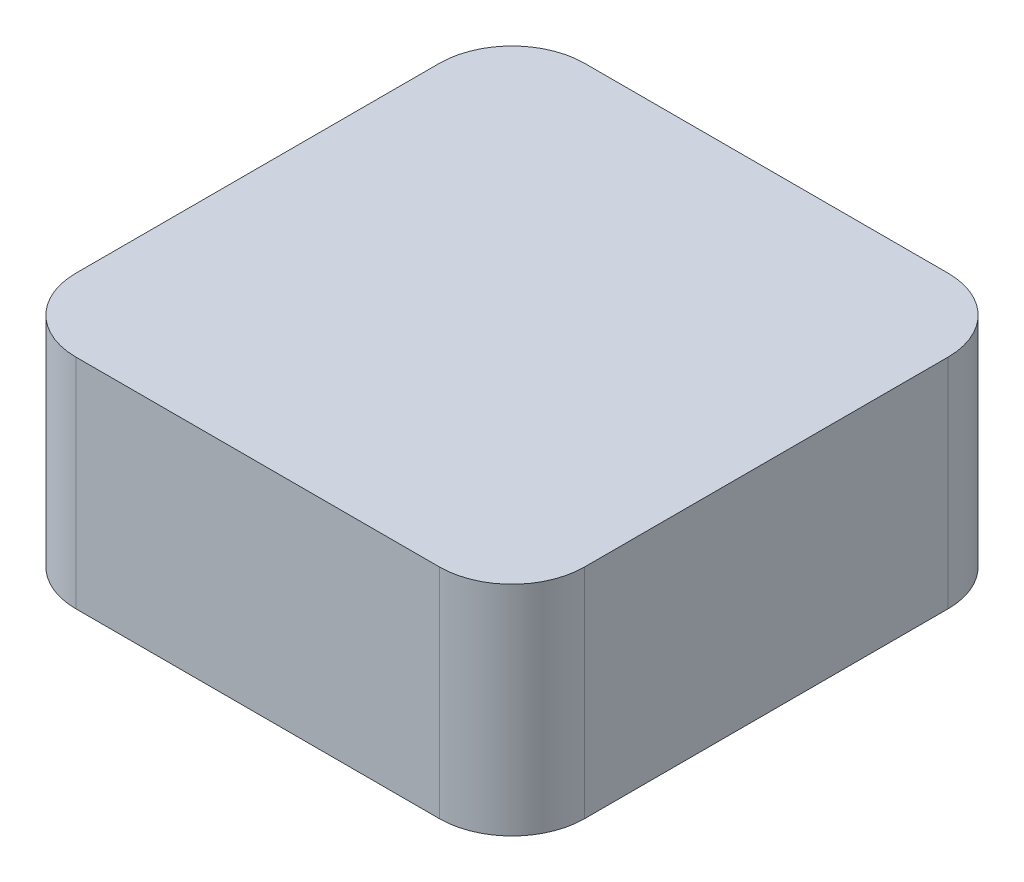
ISO-10303-21;
HEADER;
FILE_DESCRIPTION(('STEP AP214'),'2;1');
FILE_NAME('part.step','',(''),(''),'','','');
FILE_SCHEMA(('AUTOMOTIVE_DESIGN { 1 0 10303 214 1 1 1 1 }'));
ENDSEC;
DATA;
#1=APPLICATION_CONTEXT('core data for automotive mechanical design processes');
#2=APPLICATION_PROTOCOL_DEFINITION('international standard','automotive_design',2000,#1);
#3=PRODUCT_CONTEXT('',#1,'mechanical');
#4=PRODUCT('Part','Part','',(#3));
#5=PRODUCT_RELATED_PRODUCT_CATEGORY('part','',(#4));
#6=PRODUCT_DEFINITION_FORMATION('','',#4);
#7=PRODUCT_DEFINITION_CONTEXT('part definition',#1,'design');
#8=PRODUCT_DEFINITION('design','',#6,#7);
#9=PRODUCT_DEFINITION_SHAPE('','',#8);
#10=(LENGTH_UNIT() NAMED_UNIT(*) SI_UNIT(.MILLI.,.METRE.));
#11=(NAMED_UNIT(*) PLANE_ANGLE_UNIT() SI_UNIT($,.RADIAN.));
#12=(NAMED_UNIT(*) SI_UNIT($,.STERADIAN.) SOLID_ANGLE_UNIT());
#13=UNCERTAINTY_MEASURE_WITH_UNIT(LENGTH_MEASURE(1.E-05),#10,'distance_accuracy_value','');
#14=(GEOMETRIC_REPRESENTATION_CONTEXT(3) GLOBAL_UNCERTAINTY_ASSIGNED_CONTEXT((#13)) GLOBAL_UNIT_ASSIGNED_CONTEXT((#10,
#11,#12)) REPRESENTATION_CONTEXT('',''));
#15=CARTESIAN_POINT('',(0.,0.,0.));
#16=DIRECTION('',(0.,0.,1.));
#17=DIRECTION('',(1.,0.,0.));
#18=AXIS2_PLACEMENT_3D('',#15,#16,#17);
#19=CARTESIAN_POINT('',(31.75,38.1,-31.75));
#20=DIRECTION('',(0.,-1.,0.));
#21=DIRECTION('',(0.,0.,-1.));
#22=AXIS2_PLACEMENT_3D('',#19,#20,#21);
#23=CYLINDRICAL_SURFACE('',#22,12.7);
#24=CARTESIAN_POINT('',(31.75,0.,-31.75));
#25=DIRECTION('',(0.,1.,0.));
#26=DIRECTION('',(0.,0.,-1.));
#27=AXIS2_PLACEMENT_3D('',#24,#25,#26);
#28=CIRCLE('',#27,12.7);
#29=CARTESIAN_POINT('',(44.45,0.,-31.75));
#30=VERTEX_POINT('',#29);
#31=CARTESIAN_POINT('',(31.75,0.,-44.45));
#32=VERTEX_POINT('',#31);
#33=EDGE_CURVE('E129',#30,#32,#28,.T.);
#34=ORIENTED_EDGE('',*,*,#33,.T.);
#35=DIRECTION('',(0.,-1.,0.));
#36=VECTOR('',#35,1.);
#37=CARTESIAN_POINT('',(31.75,38.1,-44.45));
#38=LINE('',#37,#36);
#39=CARTESIAN_POINT('',(31.75,38.1,-44.45));
#40=VERTEX_POINT('',#39);
#41=EDGE_CURVE('E11',#40,#32,#38,.T.);
#42=ORIENTED_EDGE('',*,*,#41,.F.);
#43=CARTESIAN_POINT('',(31.75,38.1,-31.75));
#44=DIRECTION('',(0.,1.,0.));
#45=DIRECTION('',(0.,0.,-1.));
#46=AXIS2_PLACEMENT_3D('',#43,#44,#45);
#47=CIRCLE('',#46,12.7);
#48=CARTESIAN_POINT('',(44.45,38.1,-31.75));
#49=VERTEX_POINT('',#48);
#50=EDGE_CURVE('E143',#49,#40,#47,.T.);
#51=ORIENTED_EDGE('',*,*,#50,.F.);
#52=DIRECTION('',(0.,-1.,0.));
#53=VECTOR('',#52,1.);
#54=CARTESIAN_POINT('',(44.45,38.1,-31.75));
#55=LINE('',#54,#53);
#56=EDGE_CURVE('E125',#49,#30,#55,.T.);
#57=ORIENTED_EDGE('',*,*,#56,.T.);
#58=EDGE_LOOP('',(#34,#42,#51,#57));
#59=FACE_BOUND('',#58,.T.);
#60=ADVANCED_FACE('F33',(#59),#23,.T.);
#61=CARTESIAN_POINT('',(-31.75,38.1,-44.45));
#62=DIRECTION('',(0.,0.,1.));
#63=DIRECTION('',(1.,0.,0.));
#64=AXIS2_PLACEMENT_3D('',#61,#62,#63);
#65=PLANE('',#64);
#66=DIRECTION('',(-1.,0.,0.));
#67=VECTOR('',#66,1.);
#68=CARTESIAN_POINT('',(-31.75,0.,-44.45));
#69=LINE('',#68,#67);
#70=CARTESIAN_POINT('',(-31.75,0.,-44.45));
#71=VERTEX_POINT('',#70);
#72=EDGE_CURVE('E132',#32,#71,#69,.T.);
#73=ORIENTED_EDGE('',*,*,#72,.T.);
#74=DIRECTION('',(0.,-1.,0.));
#75=VECTOR('',#74,1.);
#76=CARTESIAN_POINT('',(-31.75,38.1,-44.45));
#77=LINE('',#76,#75);
#78=CARTESIAN_POINT('',(-31.75,38.1,-44.45));
#79=VERTEX_POINT('',#78);
#80=EDGE_CURVE('E41',#79,#71,#77,.T.);
#81=ORIENTED_EDGE('',*,*,#80,.F.);
#82=DIRECTION('',(-1.,0.,0.));
#83=VECTOR('',#82,1.);
#84=CARTESIAN_POINT('',(-31.75,38.1,-44.45));
#85=LINE('',#84,#83);
#86=EDGE_CURVE('E92',#40,#79,#85,.T.);
#87=ORIENTED_EDGE('',*,*,#86,.F.);
#88=ORIENTED_EDGE('',*,*,#41,.T.);
#89=EDGE_LOOP('',(#73,#81,#87,#88));
#90=FACE_BOUND('',#89,.T.);
#91=ADVANCED_FACE('F178',(#90),#65,.F.);
#92=CARTESIAN_POINT('',(-31.75,38.1,-31.75));
#93=DIRECTION('',(0.,-1.,0.));
#94=DIRECTION('',(0.,0.,-1.));
#95=AXIS2_PLACEMENT_3D('',#92,#93,#94);
#96=CYLINDRICAL_SURFACE('',#95,12.7);
#97=CARTESIAN_POINT('',(-31.75,0.,-31.75));
#98=DIRECTION('',(0.,1.,0.));
#99=DIRECTION('',(0.,0.,-1.));
#100=AXIS2_PLACEMENT_3D('',#97,#98,#99);
#101=CIRCLE('',#100,12.7);
#102=CARTESIAN_POINT('',(-44.45,0.,-31.75));
#103=VERTEX_POINT('',#102);
#104=EDGE_CURVE('E134',#71,#103,#101,.T.);
#105=ORIENTED_EDGE('',*,*,#104,.T.);
#106=DIRECTION('',(0.,-1.,0.));
#107=VECTOR('',#106,1.);
#108=CARTESIAN_POINT('',(-44.45,38.1,-31.75));
#109=LINE('',#108,#107);
#110=CARTESIAN_POINT('',(-44.45,38.1,-31.75));
#111=VERTEX_POINT('',#110);
#112=EDGE_CURVE('E150',#111,#103,#109,.T.);
#113=ORIENTED_EDGE('',*,*,#112,.F.);
#114=CARTESIAN_POINT('',(-31.75,38.1,-31.75));
#115=DIRECTION('',(0.,1.,0.));
#116=DIRECTION('',(0.,0.,-1.));
#117=AXIS2_PLACEMENT_3D('',#114,#115,#116);
#118=CIRCLE('',#117,12.7);
#119=EDGE_CURVE('E158',#79,#111,#118,.T.);
#120=ORIENTED_EDGE('',*,*,#119,.F.);
#121=ORIENTED_EDGE('',*,*,#80,.T.);
#122=EDGE_LOOP('',(#105,#113,#120,#121));
#123=FACE_BOUND('',#122,.T.);
#124=ADVANCED_FACE('F156',(#123),#96,.T.);
#125=CARTESIAN_POINT('',(-44.45,38.1,31.75));
#126=DIRECTION('',(1.,0.,0.));
#127=DIRECTION('',(0.,0.,-1.));
#128=AXIS2_PLACEMENT_3D('',#125,#126,#127);
#129=PLANE('',#128);
#130=DIRECTION('',(0.,0.,1.));
#131=VECTOR('',#130,1.);
#132=CARTESIAN_POINT('',(-44.45,0.,31.75));
#133=LINE('',#132,#131);
#134=CARTESIAN_POINT('',(-44.45,0.,31.75));
#135=VERTEX_POINT('',#134);
#136=EDGE_CURVE('E136',#103,#135,#133,.T.);
#137=ORIENTED_EDGE('',*,*,#136,.T.);
#138=DIRECTION('',(0.,-1.,0.));
#139=VECTOR('',#138,1.);
#140=CARTESIAN_POINT('',(-44.45,38.1,31.75));
#141=LINE('',#140,#139);
#142=CARTESIAN_POINT('',(-44.45,38.1,31.75));
#143=VERTEX_POINT('',#142);
#144=EDGE_CURVE('E147',#143,#135,#141,.T.);
#145=ORIENTED_EDGE('',*,*,#144,.F.);
#146=DIRECTION('',(0.,0.,1.));
#147=VECTOR('',#146,1.);
#148=CARTESIAN_POINT('',(-44.45,38.1,31.75));
#149=LINE('',#148,#147);
#150=EDGE_CURVE('E170',#111,#143,#149,.T.);
#151=ORIENTED_EDGE('',*,*,#150,.F.);
#152=ORIENTED_EDGE('',*,*,#112,.T.);
#153=EDGE_LOOP('',(#137,#145,#151,#152));
#154=FACE_BOUND('',#153,.T.);
#155=ADVANCED_FACE('F166',(#154),#129,.F.);
#156=CARTESIAN_POINT('',(-31.75,38.1,31.75));
#157=DIRECTION('',(0.,-1.,0.));
#158=DIRECTION('',(0.,0.,-1.));
#159=AXIS2_PLACEMENT_3D('',#156,#157,#158);
#160=CYLINDRICAL_SURFACE('',#159,12.7);
#161=CARTESIAN_POINT('',(-31.75,0.,31.75));
#162=DIRECTION('',(0.,1.,0.));
#163=DIRECTION('',(0.,0.,-1.));
#164=AXIS2_PLACEMENT_3D('',#161,#162,#163);
#165=CIRCLE('',#164,12.7);
#166=CARTESIAN_POINT('',(-31.75,0.,44.45));
#167=VERTEX_POINT('',#166);
#168=EDGE_CURVE('E138',#135,#167,#165,.T.);
#169=ORIENTED_EDGE('',*,*,#168,.T.);
#170=DIRECTION('',(0.,-1.,0.));
#171=VECTOR('',#170,1.);
#172=CARTESIAN_POINT('',(-31.75,38.1,44.45));
#173=LINE('',#172,#171);
#174=CARTESIAN_POINT('',(-31.75,38.1,44.45));
#175=VERTEX_POINT('',#174);
#176=EDGE_CURVE('E120',#175,#167,#173,.T.);
#177=ORIENTED_EDGE('',*,*,#176,.F.);
#178=CARTESIAN_POINT('',(-31.75,38.1,31.75));
#179=DIRECTION('',(0.,1.,0.));
#180=DIRECTION('',(0.,0.,-1.));
#181=AXIS2_PLACEMENT_3D('',#178,#179,#180);
#182=CIRCLE('',#181,12.7);
#183=EDGE_CURVE('E111',#143,#175,#182,.T.);
#184=ORIENTED_EDGE('',*,*,#183,.F.);
#185=ORIENTED_EDGE('',*,*,#144,.T.);
#186=EDGE_LOOP('',(#169,#177,#184,#185));
#187=FACE_BOUND('',#186,.T.);
#188=ADVANCED_FACE('F169',(#187),#160,.T.);
#189=CARTESIAN_POINT('',(-31.75,38.1,44.45));
#190=DIRECTION('',(0.,0.,-1.));
#191=DIRECTION('',(-1.,0.,0.));
#192=AXIS2_PLACEMENT_3D('',#189,#190,#191);
#193=PLANE('',#192);
#194=DIRECTION('',(1.,0.,0.));
#195=VECTOR('',#194,1.);
#196=CARTESIAN_POINT('',(-31.75,0.,44.45));
#197=LINE('',#196,#195);
#198=CARTESIAN_POINT('',(31.75,0.,44.45));
#199=VERTEX_POINT('',#198);
#200=EDGE_CURVE('E119',#167,#199,#197,.T.);
#201=ORIENTED_EDGE('',*,*,#200,.T.);
#202=DIRECTION('',(0.,-1.,0.));
#203=VECTOR('',#202,1.);
#204=CARTESIAN_POINT('',(31.75,38.1,44.45));
#205=LINE('',#204,#203);
#206=CARTESIAN_POINT('',(31.75,38.1,44.45));
#207=VERTEX_POINT('',#206);
#208=EDGE_CURVE('E116',#207,#199,#205,.T.);
#209=ORIENTED_EDGE('',*,*,#208,.F.);
#210=DIRECTION('',(1.,0.,0.));
#211=VECTOR('',#210,1.);
#212=CARTESIAN_POINT('',(-31.75,38.1,44.45));
#213=LINE('',#212,#211);
#214=EDGE_CURVE('E105',#175,#207,#213,.T.);
#215=ORIENTED_EDGE('',*,*,#214,.F.);
#216=ORIENTED_EDGE('',*,*,#176,.T.);
#217=EDGE_LOOP('',(#201,#209,#215,#216));
#218=FACE_BOUND('',#217,.T.);
#219=ADVANCED_FACE('F117',(#218),#193,.F.);
#220=CARTESIAN_POINT('',(31.75,38.1,31.75));
#221=DIRECTION('',(0.,-1.,0.));
#222=DIRECTION('',(0.,0.,-1.));
#223=AXIS2_PLACEMENT_3D('',#220,#221,#222);
#224=CYLINDRICAL_SURFACE('',#223,12.7);
#225=CARTESIAN_POINT('',(31.75,0.,31.75));
#226=DIRECTION('',(0.,1.,0.));
#227=DIRECTION('',(0.,0.,1.));
#228=AXIS2_PLACEMENT_3D('',#225,#226,#227);
#229=CIRCLE('',#228,12.7);
#230=CARTESIAN_POINT('',(44.45,0.,31.75));
#231=VERTEX_POINT('',#230);
#232=EDGE_CURVE('E78',#199,#231,#229,.T.);
#233=ORIENTED_EDGE('',*,*,#232,.T.);
#234=DIRECTION('',(0.,-1.,0.));
#235=VECTOR('',#234,1.);
#236=CARTESIAN_POINT('',(44.45,38.1,31.75));
#237=LINE('',#236,#235);
#238=CARTESIAN_POINT('',(44.45,38.1,31.75));
#239=VERTEX_POINT('',#238);
#240=EDGE_CURVE('E121',#239,#231,#237,.T.);
#241=ORIENTED_EDGE('',*,*,#240,.F.);
#242=CARTESIAN_POINT('',(31.75,38.1,31.75));
#243=DIRECTION('',(0.,1.,0.));
#244=DIRECTION('',(0.,0.,1.));
#245=AXIS2_PLACEMENT_3D('',#242,#243,#244);
#246=CIRCLE('',#245,12.7);
#247=EDGE_CURVE('E109',#207,#239,#246,.T.);
#248=ORIENTED_EDGE('',*,*,#247,.F.);
#249=ORIENTED_EDGE('',*,*,#208,.T.);
#250=EDGE_LOOP('',(#233,#241,#248,#249));
#251=FACE_BOUND('',#250,.T.);
#252=ADVANCED_FACE('F123',(#251),#224,.T.);
#253=CARTESIAN_POINT('',(44.45,38.1,31.75));
#254=DIRECTION('',(-1.,0.,0.));
#255=DIRECTION('',(0.,0.,1.));
#256=AXIS2_PLACEMENT_3D('',#253,#254,#255);
#257=PLANE('',#256);
#258=DIRECTION('',(0.,0.,-1.));
#259=VECTOR('',#258,1.);
#260=CARTESIAN_POINT('',(44.45,0.,31.75));
#261=LINE('',#260,#259);
#262=EDGE_CURVE('E84',#231,#30,#261,.T.);
#263=ORIENTED_EDGE('',*,*,#262,.T.);
#264=ORIENTED_EDGE('',*,*,#56,.F.);
#265=DIRECTION('',(0.,0.,-1.));
#266=VECTOR('',#265,1.);
#267=CARTESIAN_POINT('',(44.45,38.1,31.75));
#268=LINE('',#267,#266);
#269=EDGE_CURVE('E49',#239,#49,#268,.T.);
#270=ORIENTED_EDGE('',*,*,#269,.F.);
#271=ORIENTED_EDGE('',*,*,#240,.T.);
#272=EDGE_LOOP('',(#263,#264,#270,#271));
#273=FACE_BOUND('',#272,.T.);
#274=ADVANCED_FACE('F194',(#273),#257,.F.);
#275=CARTESIAN_POINT('',(31.75,38.1,-31.75));
#276=DIRECTION('',(0.,-1.,0.));
#277=DIRECTION('',(0.,0.,-1.));
#278=AXIS2_PLACEMENT_3D('',#275,#276,#277);
#279=PLANE('',#278);
#280=ORIENTED_EDGE('',*,*,#50,.T.);
#281=ORIENTED_EDGE('',*,*,#86,.T.);
#282=ORIENTED_EDGE('',*,*,#119,.T.);
#283=ORIENTED_EDGE('',*,*,#150,.T.);
#284=ORIENTED_EDGE('',*,*,#183,.T.);
#285=ORIENTED_EDGE('',*,*,#214,.T.);
#286=ORIENTED_EDGE('',*,*,#247,.T.);
#287=ORIENTED_EDGE('',*,*,#269,.T.);
#288=EDGE_LOOP('',(#280,#281,#282,#283,#284,#285,#286,#287));
#289=FACE_BOUND('',#288,.T.);
#290=ADVANCED_FACE('F107',(#289),#279,.F.);
#291=CARTESIAN_POINT('',(31.75,0.,-31.75));
#292=DIRECTION('',(0.,-1.,0.));
#293=DIRECTION('',(0.,0.,-1.));
#294=AXIS2_PLACEMENT_3D('',#291,#292,#293);
#295=PLANE('',#294);
#296=ORIENTED_EDGE('',*,*,#33,.F.);
#297=ORIENTED_EDGE('',*,*,#262,.F.);
#298=ORIENTED_EDGE('',*,*,#232,.F.);
#299=ORIENTED_EDGE('',*,*,#200,.F.);
#300=ORIENTED_EDGE('',*,*,#168,.F.);
#301=ORIENTED_EDGE('',*,*,#136,.F.);
#302=ORIENTED_EDGE('',*,*,#104,.F.);
#303=ORIENTED_EDGE('',*,*,#72,.F.);
#304=EDGE_LOOP('',(#296,#297,#298,#299,#300,#301,#302,#303));
#305=FACE_BOUND('',#304,.T.);
#306=ADVANCED_FACE('F162',(#305),#295,.T.);
#307=CLOSED_SHELL('',(#60,#91,#124,#155,#188,#219,#252,#274,#290,#306));
#308=MANIFOLD_SOLID_BREP('B2',#307);
#309=ADVANCED_BREP_SHAPE_REPRESENTATION('',(#18,#308),#14);
#310=SHAPE_DEFINITION_REPRESENTATION(#9,#309);
ENDSEC;
END-ISO-10303-21;
